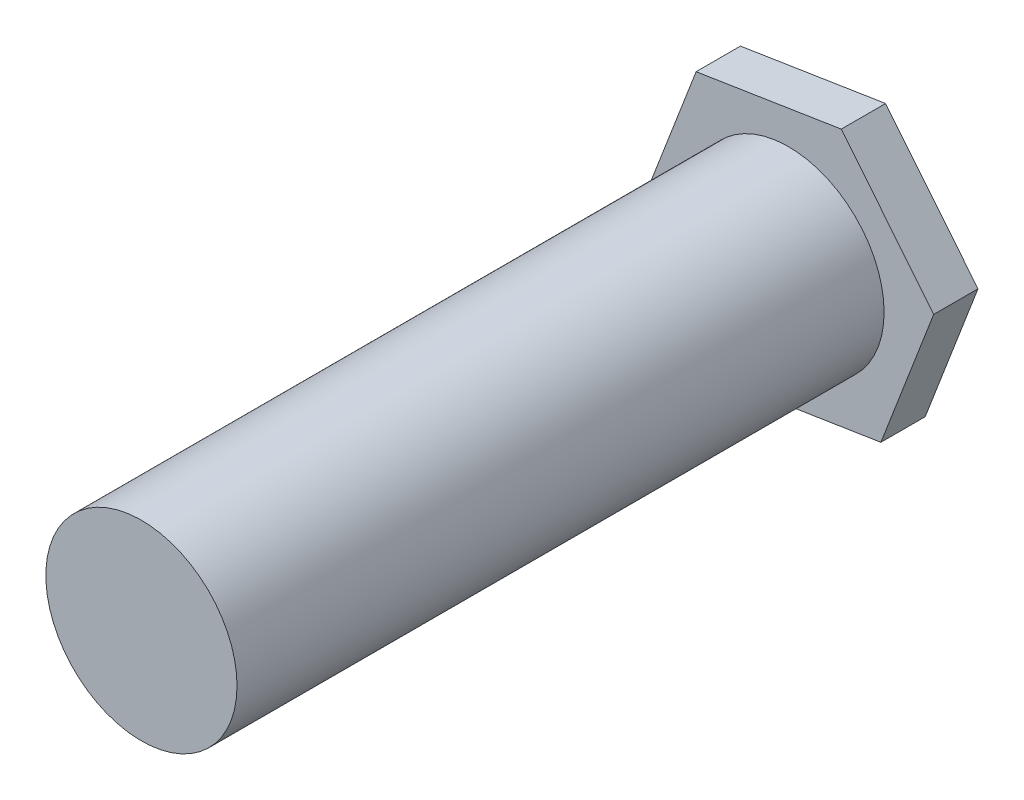
ISO-10303-21;
HEADER;
FILE_DESCRIPTION(('STEP AP214'),'2;1');
FILE_NAME('part.step','',(''),(''),'','','');
FILE_SCHEMA(('AUTOMOTIVE_DESIGN { 1 0 10303 214 1 1 1 1 }'));
ENDSEC;
DATA;
#1=APPLICATION_CONTEXT('core data for automotive mechanical design processes');
#2=APPLICATION_PROTOCOL_DEFINITION('international standard','automotive_design',2000,#1);
#3=PRODUCT_CONTEXT('',#1,'mechanical');
#4=PRODUCT('Part','Part','',(#3));
#5=PRODUCT_RELATED_PRODUCT_CATEGORY('part','',(#4));
#6=PRODUCT_DEFINITION_FORMATION('','',#4);
#7=PRODUCT_DEFINITION_CONTEXT('part definition',#1,'design');
#8=PRODUCT_DEFINITION('design','',#6,#7);
#9=PRODUCT_DEFINITION_SHAPE('','',#8);
#10=(LENGTH_UNIT() NAMED_UNIT(*) SI_UNIT(.MILLI.,.METRE.));
#11=(NAMED_UNIT(*) PLANE_ANGLE_UNIT() SI_UNIT($,.RADIAN.));
#12=(NAMED_UNIT(*) SI_UNIT($,.STERADIAN.) SOLID_ANGLE_UNIT());
#13=UNCERTAINTY_MEASURE_WITH_UNIT(LENGTH_MEASURE(1.E-05),#10,'distance_accuracy_value','');
#14=(GEOMETRIC_REPRESENTATION_CONTEXT(3) GLOBAL_UNCERTAINTY_ASSIGNED_CONTEXT((#13)) GLOBAL_UNIT_ASSIGNED_CONTEXT((#10,
#11,#12)) REPRESENTATION_CONTEXT('',''));
#15=CARTESIAN_POINT('',(0.,0.,0.));
#16=DIRECTION('',(0.,0.,1.));
#17=DIRECTION('',(1.,0.,0.));
#18=AXIS2_PLACEMENT_3D('',#15,#16,#17);
#19=CARTESIAN_POINT('',(0.,0.,-0.508));
#20=DIRECTION('',(0.,0.,1.));
#21=DIRECTION('',(1.,0.,0.));
#22=AXIS2_PLACEMENT_3D('',#19,#20,#21);
#23=CYLINDRICAL_SURFACE('',#22,2.73924182004119);
#24=CARTESIAN_POINT('',(0.,0.,-0.508));
#25=DIRECTION('',(0.,0.,1.));
#26=DIRECTION('',(1.,0.,0.));
#27=AXIS2_PLACEMENT_3D('',#24,#25,#26);
#28=CIRCLE('',#27,2.73924182004119);
#29=CARTESIAN_POINT('',(2.73924182004119,0.,-0.508));
#30=VERTEX_POINT('',#29);
#31=EDGE_CURVE('E48',#30,#30,#28,.T.);
#32=ORIENTED_EDGE('',*,*,#31,.T.);
#33=EDGE_LOOP('',(#32));
#34=FACE_BOUND('',#33,.T.);
#35=CARTESIAN_POINT('',(0.,0.,18.034));
#36=DIRECTION('',(0.,0.,1.));
#37=DIRECTION('',(1.,0.,0.));
#38=AXIS2_PLACEMENT_3D('',#35,#36,#37);
#39=CIRCLE('',#38,2.73924182004119);
#40=CARTESIAN_POINT('',(2.73924182004119,0.,18.034));
#41=VERTEX_POINT('',#40);
#42=EDGE_CURVE('E11',#41,#41,#39,.T.);
#43=ORIENTED_EDGE('',*,*,#42,.F.);
#44=EDGE_LOOP('',(#43));
#45=FACE_BOUND('',#44,.T.);
#46=ADVANCED_FACE('F45',(#34,#45),#23,.T.);
#47=CARTESIAN_POINT('',(0.,0.,18.034));
#48=DIRECTION('',(0.,0.,1.));
#49=DIRECTION('',(1.,0.,0.));
#50=AXIS2_PLACEMENT_3D('',#47,#48,#49);
#51=PLANE('',#50);
#52=ORIENTED_EDGE('',*,*,#42,.T.);
#53=EDGE_LOOP('',(#52));
#54=FACE_BOUND('',#53,.T.);
#55=ADVANCED_FACE('F190',(#54),#51,.T.);
#56=CARTESIAN_POINT('',(-4.16026958079843,-0.655165078189782,-1.77800000000002));
#57=DIRECTION('',(0.933264319079848,-0.359190354453494,0.));
#58=DIRECTION('',(0.359190354453494,0.933264319079848,0.));
#59=AXIS2_PLACEMENT_3D('',#56,#57,#58);
#60=PLANE('',#59);
#61=DIRECTION('',(0.359190354453494,0.933264319079848,0.));
#62=VECTOR('',#61,1.);
#63=CARTESIAN_POINT('',(-4.16026958079843,-0.655165078189782,-0.508));
#64=LINE('',#63,#62);
#65=CARTESIAN_POINT('',(-4.16026958079843,-0.655165078189782,-0.508));
#66=VERTEX_POINT('',#65);
#67=CARTESIAN_POINT('',(-2.64752439178399,3.27531660446819,-0.508));
#68=VERTEX_POINT('',#67);
#69=EDGE_CURVE('E135',#66,#68,#64,.T.);
#70=ORIENTED_EDGE('',*,*,#69,.T.);
#71=DIRECTION('',(0.,0.,1.));
#72=VECTOR('',#71,1.);
#73=CARTESIAN_POINT('',(-2.64752439178399,3.27531660446819,-1.77800000000002));
#74=LINE('',#73,#72);
#75=CARTESIAN_POINT('',(-2.64752439178399,3.27531660446819,-1.77800000000002));
#76=VERTEX_POINT('',#75);
#77=EDGE_CURVE('E162',#76,#68,#74,.T.);
#78=ORIENTED_EDGE('',*,*,#77,.F.);
#79=DIRECTION('',(0.359190354453494,0.933264319079848,0.));
#80=VECTOR('',#79,1.);
#81=CARTESIAN_POINT('',(-4.16026958079843,-0.655165078189782,-1.77800000000002));
#82=LINE('',#81,#80);
#83=CARTESIAN_POINT('',(-4.16026958079843,-0.655165078189782,-1.77800000000002));
#84=VERTEX_POINT('',#83);
#85=EDGE_CURVE('E151',#84,#76,#82,.T.);
#86=ORIENTED_EDGE('',*,*,#85,.F.);
#87=DIRECTION('',(0.,0.,1.));
#88=VECTOR('',#87,1.);
#89=CARTESIAN_POINT('',(-4.16026958079843,-0.655165078189782,-1.77800000000002));
#90=LINE('',#89,#88);
#91=EDGE_CURVE('E131',#84,#66,#90,.T.);
#92=ORIENTED_EDGE('',*,*,#91,.T.);
#93=EDGE_LOOP('',(#70,#78,#86,#92));
#94=FACE_BOUND('',#93,.T.);
#95=ADVANCED_FACE('F178',(#94),#60,.F.);
#96=CARTESIAN_POINT('',(-2.64752439178399,3.27531660446819,-1.77800000000002));
#97=DIRECTION('',(0.155564187788861,-0.987825785995482,0.));
#98=DIRECTION('',(0.987825785995482,0.155564187788861,0.));
#99=AXIS2_PLACEMENT_3D('',#96,#97,#98);
#100=PLANE('',#99);
#101=DIRECTION('',(0.987825785995482,0.155564187788861,0.));
#102=VECTOR('',#101,1.);
#103=CARTESIAN_POINT('',(-2.64752439178399,3.27531660446819,-0.508));
#104=LINE('',#103,#102);
#105=CARTESIAN_POINT('',(1.51274518901444,3.93048168265797,-0.508));
#106=VERTEX_POINT('',#105);
#107=EDGE_CURVE('E139',#68,#106,#104,.T.);
#108=ORIENTED_EDGE('',*,*,#107,.T.);
#109=DIRECTION('',(0.,0.,1.));
#110=VECTOR('',#109,1.);
#111=CARTESIAN_POINT('',(1.51274518901444,3.93048168265797,-1.77800000000002));
#112=LINE('',#111,#110);
#113=CARTESIAN_POINT('',(1.51274518901444,3.93048168265797,-1.77800000000002));
#114=VERTEX_POINT('',#113);
#115=EDGE_CURVE('E158',#114,#106,#112,.T.);
#116=ORIENTED_EDGE('',*,*,#115,.F.);
#117=DIRECTION('',(0.987825785995482,0.155564187788861,0.));
#118=VECTOR('',#117,1.);
#119=CARTESIAN_POINT('',(-2.64752439178399,3.27531660446819,-1.77800000000002));
#120=LINE('',#119,#118);
#121=EDGE_CURVE('E100',#76,#114,#120,.T.);
#122=ORIENTED_EDGE('',*,*,#121,.F.);
#123=ORIENTED_EDGE('',*,*,#77,.T.);
#124=EDGE_LOOP('',(#108,#116,#122,#123));
#125=FACE_BOUND('',#124,.T.);
#126=ADVANCED_FACE('F198',(#125),#100,.F.);
#127=CARTESIAN_POINT('',(1.51274518901444,3.93048168265797,-1.77800000000002));
#128=DIRECTION('',(-0.777700131290987,-0.628635431541988,0.));
#129=DIRECTION('',(0.628635431541988,-0.777700131290987,0.));
#130=AXIS2_PLACEMENT_3D('',#127,#128,#129);
#131=PLANE('',#130);
#132=DIRECTION('',(0.628635431541988,-0.777700131290987,0.));
#133=VECTOR('',#132,1.);
#134=CARTESIAN_POINT('',(1.51274518901444,3.93048168265797,-0.508));
#135=LINE('',#134,#133);
#136=CARTESIAN_POINT('',(4.16026958079843,0.655165078189782,-0.508));
#137=VERTEX_POINT('',#136);
#138=EDGE_CURVE('E142',#106,#137,#135,.T.);
#139=ORIENTED_EDGE('',*,*,#138,.T.);
#140=DIRECTION('',(0.,0.,1.));
#141=VECTOR('',#140,1.);
#142=CARTESIAN_POINT('',(4.16026958079843,0.655165078189782,-1.77800000000002));
#143=LINE('',#142,#141);
#144=CARTESIAN_POINT('',(4.16026958079843,0.655165078189782,-1.77800000000002));
#145=VERTEX_POINT('',#144);
#146=EDGE_CURVE('E124',#145,#137,#143,.T.);
#147=ORIENTED_EDGE('',*,*,#146,.F.);
#148=DIRECTION('',(0.628635431541988,-0.777700131290987,0.));
#149=VECTOR('',#148,1.);
#150=CARTESIAN_POINT('',(1.51274518901444,3.93048168265797,-1.77800000000002));
#151=LINE('',#150,#149);
#152=EDGE_CURVE('E113',#114,#145,#151,.T.);
#153=ORIENTED_EDGE('',*,*,#152,.F.);
#154=ORIENTED_EDGE('',*,*,#115,.T.);
#155=EDGE_LOOP('',(#139,#147,#153,#154));
#156=FACE_BOUND('',#155,.T.);
#157=ADVANCED_FACE('F203',(#156),#131,.F.);
#158=CARTESIAN_POINT('',(4.16026958079843,0.655165078189782,-1.77800000000002));
#159=DIRECTION('',(-0.933264319079848,0.359190354453494,0.));
#160=DIRECTION('',(-0.359190354453494,-0.933264319079848,0.));
#161=AXIS2_PLACEMENT_3D('',#158,#159,#160);
#162=PLANE('',#161);
#163=DIRECTION('',(-0.359190354453494,-0.933264319079848,0.));
#164=VECTOR('',#163,1.);
#165=CARTESIAN_POINT('',(4.16026958079843,0.655165078189782,-0.508));
#166=LINE('',#165,#164);
#167=CARTESIAN_POINT('',(2.64752439178398,-3.27531660446819,-0.508));
#168=VERTEX_POINT('',#167);
#169=EDGE_CURVE('E122',#137,#168,#166,.T.);
#170=ORIENTED_EDGE('',*,*,#169,.T.);
#171=DIRECTION('',(0.,0.,1.));
#172=VECTOR('',#171,1.);
#173=CARTESIAN_POINT('',(2.64752439178398,-3.27531660446819,-1.77800000000002));
#174=LINE('',#173,#172);
#175=CARTESIAN_POINT('',(2.64752439178398,-3.27531660446819,-1.77800000000002));
#176=VERTEX_POINT('',#175);
#177=EDGE_CURVE('E119',#176,#168,#174,.T.);
#178=ORIENTED_EDGE('',*,*,#177,.F.);
#179=DIRECTION('',(-0.359190354453494,-0.933264319079848,0.));
#180=VECTOR('',#179,1.);
#181=CARTESIAN_POINT('',(4.16026958079843,0.655165078189782,-1.77800000000002));
#182=LINE('',#181,#180);
#183=EDGE_CURVE('E107',#145,#176,#182,.T.);
#184=ORIENTED_EDGE('',*,*,#183,.F.);
#185=ORIENTED_EDGE('',*,*,#146,.T.);
#186=EDGE_LOOP('',(#170,#178,#184,#185));
#187=FACE_BOUND('',#186,.T.);
#188=ADVANCED_FACE('F120',(#187),#162,.F.);
#189=CARTESIAN_POINT('',(2.64752439178398,-3.27531660446819,-1.77800000000002));
#190=DIRECTION('',(-0.155564187788861,0.987825785995482,0.));
#191=DIRECTION('',(-0.987825785995482,-0.155564187788861,0.));
#192=AXIS2_PLACEMENT_3D('',#189,#190,#191);
#193=PLANE('',#192);
#194=DIRECTION('',(-0.987825785995482,-0.155564187788861,0.));
#195=VECTOR('',#194,1.);
#196=CARTESIAN_POINT('',(2.64752439178398,-3.27531660446819,-0.508));
#197=LINE('',#196,#195);
#198=CARTESIAN_POINT('',(-1.51274518901445,-3.93048168265797,-0.508));
#199=VERTEX_POINT('',#198);
#200=EDGE_CURVE('E85',#168,#199,#197,.T.);
#201=ORIENTED_EDGE('',*,*,#200,.T.);
#202=DIRECTION('',(0.,0.,1.));
#203=VECTOR('',#202,1.);
#204=CARTESIAN_POINT('',(-1.51274518901445,-3.93048168265797,-1.77800000000002));
#205=LINE('',#204,#203);
#206=CARTESIAN_POINT('',(-1.51274518901445,-3.93048168265797,-1.77800000000002));
#207=VERTEX_POINT('',#206);
#208=EDGE_CURVE('E125',#207,#199,#205,.T.);
#209=ORIENTED_EDGE('',*,*,#208,.F.);
#210=DIRECTION('',(-0.987825785995482,-0.155564187788861,0.));
#211=VECTOR('',#210,1.);
#212=CARTESIAN_POINT('',(2.64752439178398,-3.27531660446819,-1.77800000000002));
#213=LINE('',#212,#211);
#214=EDGE_CURVE('E111',#176,#207,#213,.T.);
#215=ORIENTED_EDGE('',*,*,#214,.F.);
#216=ORIENTED_EDGE('',*,*,#177,.T.);
#217=EDGE_LOOP('',(#201,#209,#215,#216));
#218=FACE_BOUND('',#217,.T.);
#219=ADVANCED_FACE('F127',(#218),#193,.F.);
#220=CARTESIAN_POINT('',(-1.51274518901445,-3.93048168265797,-1.77800000000002));
#221=DIRECTION('',(0.777700131290987,0.628635431541988,0.));
#222=DIRECTION('',(-0.628635431541988,0.777700131290987,0.));
#223=AXIS2_PLACEMENT_3D('',#220,#221,#222);
#224=PLANE('',#223);
#225=DIRECTION('',(-0.628635431541988,0.777700131290987,0.));
#226=VECTOR('',#225,1.);
#227=CARTESIAN_POINT('',(-1.51274518901445,-3.93048168265797,-0.508));
#228=LINE('',#227,#226);
#229=EDGE_CURVE('E91',#199,#66,#228,.T.);
#230=ORIENTED_EDGE('',*,*,#229,.T.);
#231=ORIENTED_EDGE('',*,*,#91,.F.);
#232=DIRECTION('',(-0.628635431541988,0.777700131290987,0.));
#233=VECTOR('',#232,1.);
#234=CARTESIAN_POINT('',(-1.51274518901445,-3.93048168265797,-1.77800000000002));
#235=LINE('',#234,#233);
#236=EDGE_CURVE('E62',#207,#84,#235,.T.);
#237=ORIENTED_EDGE('',*,*,#236,.F.);
#238=ORIENTED_EDGE('',*,*,#208,.T.);
#239=EDGE_LOOP('',(#230,#231,#237,#238));
#240=FACE_BOUND('',#239,.T.);
#241=ADVANCED_FACE('F180',(#240),#224,.F.);
#242=CARTESIAN_POINT('',(0.,0.,-1.77800000000002));
#243=DIRECTION('',(0.,0.,-1.));
#244=DIRECTION('',(-1.,0.,0.));
#245=AXIS2_PLACEMENT_3D('',#242,#243,#244);
#246=PLANE('',#245);
#247=ORIENTED_EDGE('',*,*,#85,.T.);
#248=ORIENTED_EDGE('',*,*,#121,.T.);
#249=ORIENTED_EDGE('',*,*,#152,.T.);
#250=ORIENTED_EDGE('',*,*,#183,.T.);
#251=ORIENTED_EDGE('',*,*,#214,.T.);
#252=ORIENTED_EDGE('',*,*,#236,.T.);
#253=EDGE_LOOP('',(#247,#248,#249,#250,#251,#252));
#254=FACE_BOUND('',#253,.T.);
#255=ADVANCED_FACE('F109',(#254),#246,.T.);
#256=CARTESIAN_POINT('',(0.,0.,-0.508));
#257=DIRECTION('',(0.,0.,-1.));
#258=DIRECTION('',(-1.,0.,0.));
#259=AXIS2_PLACEMENT_3D('',#256,#257,#258);
#260=PLANE('',#259);
#261=ORIENTED_EDGE('',*,*,#31,.F.);
#262=EDGE_LOOP('',(#261));
#263=FACE_BOUND('',#262,.T.);
#264=ORIENTED_EDGE('',*,*,#69,.F.);
#265=ORIENTED_EDGE('',*,*,#229,.F.);
#266=ORIENTED_EDGE('',*,*,#200,.F.);
#267=ORIENTED_EDGE('',*,*,#169,.F.);
#268=ORIENTED_EDGE('',*,*,#138,.F.);
#269=ORIENTED_EDGE('',*,*,#107,.F.);
#270=EDGE_LOOP('',(#264,#265,#266,#267,#268,#269));
#271=FACE_BOUND('',#270,.T.);
#272=ADVANCED_FACE('F171',(#263,#271),#260,.F.);
#273=CLOSED_SHELL('',(#46,#55,#95,#126,#157,#188,#219,#241,#255,#272));
#274=MANIFOLD_SOLID_BREP('B2',#273);
#275=ADVANCED_BREP_SHAPE_REPRESENTATION('',(#18,#274),#14);
#276=SHAPE_DEFINITION_REPRESENTATION(#9,#275);
ENDSEC;
END-ISO-10303-21;
